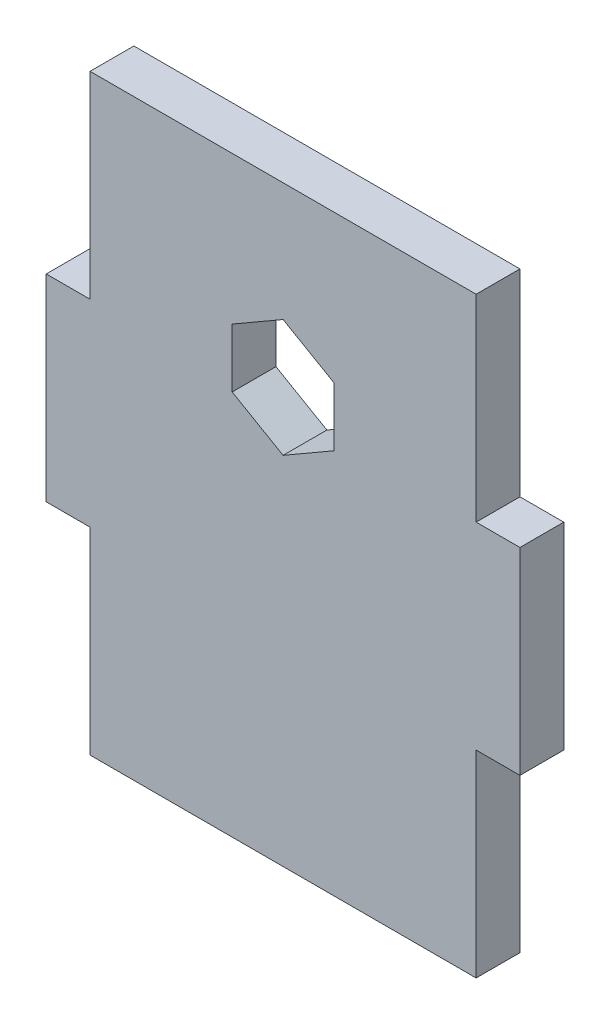
ISO-10303-21;
HEADER;
FILE_DESCRIPTION(('STEP AP214'),'2;1');
FILE_NAME('part.step','',(''),(''),'','','');
FILE_SCHEMA(('AUTOMOTIVE_DESIGN { 1 0 10303 214 1 1 1 1 }'));
ENDSEC;
DATA;
#1=APPLICATION_CONTEXT('core data for automotive mechanical design processes');
#2=APPLICATION_PROTOCOL_DEFINITION('international standard','automotive_design',2000,#1);
#3=PRODUCT_CONTEXT('',#1,'mechanical');
#4=PRODUCT('Part','Part','',(#3));
#5=PRODUCT_RELATED_PRODUCT_CATEGORY('part','',(#4));
#6=PRODUCT_DEFINITION_FORMATION('','',#4);
#7=PRODUCT_DEFINITION_CONTEXT('part definition',#1,'design');
#8=PRODUCT_DEFINITION('design','',#6,#7);
#9=PRODUCT_DEFINITION_SHAPE('','',#8);
#10=(LENGTH_UNIT() NAMED_UNIT(*) SI_UNIT(.MILLI.,.METRE.));
#11=(NAMED_UNIT(*) PLANE_ANGLE_UNIT() SI_UNIT($,.RADIAN.));
#12=(NAMED_UNIT(*) SI_UNIT($,.STERADIAN.) SOLID_ANGLE_UNIT());
#13=UNCERTAINTY_MEASURE_WITH_UNIT(LENGTH_MEASURE(1.E-05),#10,'distance_accuracy_value','');
#14=(GEOMETRIC_REPRESENTATION_CONTEXT(3) GLOBAL_UNCERTAINTY_ASSIGNED_CONTEXT((#13)) GLOBAL_UNIT_ASSIGNED_CONTEXT((#10,
#11,#12)) REPRESENTATION_CONTEXT('',''));
#15=CARTESIAN_POINT('',(0.,0.,0.));
#16=DIRECTION('',(0.,0.,1.));
#17=DIRECTION('',(1.,0.,0.));
#18=AXIS2_PLACEMENT_3D('',#15,#16,#17);
#19=CARTESIAN_POINT('',(0.,0.,4.699));
#20=DIRECTION('',(0.,0.,1.));
#21=DIRECTION('',(1.,0.,0.));
#22=AXIS2_PLACEMENT_3D('',#19,#20,#21);
#23=PLANE('',#22);
#24=DIRECTION('',(0.,-1.,0.));
#25=VECTOR('',#24,1.);
#26=CARTESIAN_POINT('',(0.,0.,4.699));
#27=LINE('',#26,#25);
#28=CARTESIAN_POINT('',(0.,21.1666666666667,4.699));
#29=VERTEX_POINT('',#28);
#30=CARTESIAN_POINT('',(0.,0.,4.699));
#31=VERTEX_POINT('',#30);
#32=EDGE_CURVE('E196',#29,#31,#27,.T.);
#33=ORIENTED_EDGE('',*,*,#32,.T.);
#34=DIRECTION('',(1.,0.,0.));
#35=VECTOR('',#34,1.);
#36=CARTESIAN_POINT('',(0.,0.,4.699));
#37=LINE('',#36,#35);
#38=CARTESIAN_POINT('',(41.402,0.,4.699));
#39=VERTEX_POINT('',#38);
#40=EDGE_CURVE('E199',#31,#39,#37,.T.);
#41=ORIENTED_EDGE('',*,*,#40,.T.);
#42=DIRECTION('',(0.,1.,0.));
#43=VECTOR('',#42,1.);
#44=CARTESIAN_POINT('',(41.402,0.,4.699));
#45=LINE('',#44,#43);
#46=CARTESIAN_POINT('',(41.402,21.1666666666667,4.699));
#47=VERTEX_POINT('',#46);
#48=EDGE_CURVE('E202',#39,#47,#45,.T.);
#49=ORIENTED_EDGE('',*,*,#48,.T.);
#50=DIRECTION('',(1.,0.,0.));
#51=VECTOR('',#50,1.);
#52=CARTESIAN_POINT('',(41.402,21.1666666666667,4.699));
#53=LINE('',#52,#51);
#54=CARTESIAN_POINT('',(46.101,21.1666666666667,4.699));
#55=VERTEX_POINT('',#54);
#56=EDGE_CURVE('E204',#47,#55,#53,.T.);
#57=ORIENTED_EDGE('',*,*,#56,.T.);
#58=DIRECTION('',(0.,1.,0.));
#59=VECTOR('',#58,1.);
#60=CARTESIAN_POINT('',(46.101,42.3333333333333,4.699));
#61=LINE('',#60,#59);
#62=CARTESIAN_POINT('',(46.101,42.3333333333333,4.699));
#63=VERTEX_POINT('',#62);
#64=EDGE_CURVE('E206',#55,#63,#61,.T.);
#65=ORIENTED_EDGE('',*,*,#64,.T.);
#66=DIRECTION('',(-1.,0.,0.));
#67=VECTOR('',#66,1.);
#68=CARTESIAN_POINT('',(41.402,42.3333333333333,4.699));
#69=LINE('',#68,#67);
#70=CARTESIAN_POINT('',(41.402,42.3333333333333,4.699));
#71=VERTEX_POINT('',#70);
#72=EDGE_CURVE('E208',#63,#71,#69,.T.);
#73=ORIENTED_EDGE('',*,*,#72,.T.);
#74=DIRECTION('',(0.,1.,0.));
#75=VECTOR('',#74,1.);
#76=CARTESIAN_POINT('',(41.402,42.3333333333333,4.699));
#77=LINE('',#76,#75);
#78=CARTESIAN_POINT('',(41.402,63.5,4.699));
#79=VERTEX_POINT('',#78);
#80=EDGE_CURVE('E210',#71,#79,#77,.T.);
#81=ORIENTED_EDGE('',*,*,#80,.T.);
#82=DIRECTION('',(-1.,0.,0.));
#83=VECTOR('',#82,1.);
#84=CARTESIAN_POINT('',(0.,63.5,4.699));
#85=LINE('',#84,#83);
#86=CARTESIAN_POINT('',(0.,63.5,4.699));
#87=VERTEX_POINT('',#86);
#88=EDGE_CURVE('E212',#79,#87,#85,.T.);
#89=ORIENTED_EDGE('',*,*,#88,.T.);
#90=DIRECTION('',(0.,-1.,0.));
#91=VECTOR('',#90,1.);
#92=CARTESIAN_POINT('',(0.,42.3333333333333,4.699));
#93=LINE('',#92,#91);
#94=CARTESIAN_POINT('',(0.,42.3333333333333,4.699));
#95=VERTEX_POINT('',#94);
#96=EDGE_CURVE('E214',#87,#95,#93,.T.);
#97=ORIENTED_EDGE('',*,*,#96,.T.);
#98=DIRECTION('',(-1.,0.,0.));
#99=VECTOR('',#98,1.);
#100=CARTESIAN_POINT('',(0.,42.3333333333333,4.699));
#101=LINE('',#100,#99);
#102=CARTESIAN_POINT('',(-4.699,42.3333333333333,4.699));
#103=VERTEX_POINT('',#102);
#104=EDGE_CURVE('E216',#95,#103,#101,.T.);
#105=ORIENTED_EDGE('',*,*,#104,.T.);
#106=DIRECTION('',(0.,-1.,0.));
#107=VECTOR('',#106,1.);
#108=CARTESIAN_POINT('',(-4.699,42.3333333333333,4.699));
#109=LINE('',#108,#107);
#110=CARTESIAN_POINT('',(-4.699,21.1666666666667,4.699));
#111=VERTEX_POINT('',#110);
#112=EDGE_CURVE('E218',#103,#111,#109,.T.);
#113=ORIENTED_EDGE('',*,*,#112,.T.);
#114=DIRECTION('',(1.,0.,0.));
#115=VECTOR('',#114,1.);
#116=CARTESIAN_POINT('',(0.,21.1666666666667,4.699));
#117=LINE('',#116,#115);
#118=EDGE_CURVE('E220',#111,#29,#117,.T.);
#119=ORIENTED_EDGE('',*,*,#118,.T.);
#120=EDGE_LOOP('',(#33,#41,#49,#57,#65,#73,#81,#89,#97,#105,#113,#119));
#121=FACE_BOUND('',#120,.T.);
#122=DIRECTION('',(0.866025403784436,0.500000000000005,0.));
#123=VECTOR('',#122,1.);
#124=CARTESIAN_POINT('',(26.162,41.3412705398664,4.69899999999999));
#125=LINE('',#124,#123);
#126=CARTESIAN_POINT('',(20.701,38.1883607198218,4.69899999999999));
#127=VERTEX_POINT('',#126);
#128=CARTESIAN_POINT('',(26.162,41.3412705398664,4.69899999999999));
#129=VERTEX_POINT('',#128);
#130=EDGE_CURVE('E165',#127,#129,#125,.T.);
#131=ORIENTED_EDGE('',*,*,#130,.F.);
#132=DIRECTION('',(0.86602540378444,-0.499999999999998,0.));
#133=VECTOR('',#132,1.);
#134=CARTESIAN_POINT('',(20.701,38.1883607198218,4.69899999999999));
#135=LINE('',#134,#133);
#136=CARTESIAN_POINT('',(15.24,41.3412705398663,4.69899999999999));
#137=VERTEX_POINT('',#136);
#138=EDGE_CURVE('E157',#137,#127,#135,.T.);
#139=ORIENTED_EDGE('',*,*,#138,.F.);
#140=DIRECTION('',(0.,-1.,0.));
#141=VECTOR('',#140,1.);
#142=CARTESIAN_POINT('',(15.24,41.3412705398663,4.69899999999999));
#143=LINE('',#142,#141);
#144=CARTESIAN_POINT('',(15.24,47.6470901799554,4.699));
#145=VERTEX_POINT('',#144);
#146=EDGE_CURVE('E185',#145,#137,#143,.T.);
#147=ORIENTED_EDGE('',*,*,#146,.F.);
#148=DIRECTION('',(-0.866025403784436,-0.500000000000004,0.));
#149=VECTOR('',#148,1.);
#150=CARTESIAN_POINT('',(15.24,47.6470901799554,4.69899999999999));
#151=LINE('',#150,#149);
#152=CARTESIAN_POINT('',(20.701,50.8,4.69899999999999));
#153=VERTEX_POINT('',#152);
#154=EDGE_CURVE('E183',#153,#145,#151,.T.);
#155=ORIENTED_EDGE('',*,*,#154,.F.);
#156=DIRECTION('',(-0.86602540378444,0.499999999999998,0.));
#157=VECTOR('',#156,1.);
#158=CARTESIAN_POINT('',(20.701,50.8,4.69899999999999));
#159=LINE('',#158,#157);
#160=CARTESIAN_POINT('',(26.162,47.6470901799555,4.69899999999999));
#161=VERTEX_POINT('',#160);
#162=EDGE_CURVE('E179',#161,#153,#159,.T.);
#163=ORIENTED_EDGE('',*,*,#162,.F.);
#164=DIRECTION('',(0.,1.,0.));
#165=VECTOR('',#164,1.);
#166=CARTESIAN_POINT('',(26.162,47.6470901799555,4.69899999999999));
#167=LINE('',#166,#165);
#168=EDGE_CURVE('E177',#129,#161,#167,.T.);
#169=ORIENTED_EDGE('',*,*,#168,.F.);
#170=EDGE_LOOP('',(#131,#139,#147,#155,#163,#169));
#171=FACE_BOUND('',#170,.T.);
#172=ADVANCED_FACE('F34',(#121,#171),#23,.T.);
#173=CARTESIAN_POINT('',(0.,0.,0.));
#174=DIRECTION('',(0.,0.,1.));
#175=DIRECTION('',(1.,0.,0.));
#176=AXIS2_PLACEMENT_3D('',#173,#174,#175);
#177=PLANE('',#176);
#178=DIRECTION('',(0.,-1.,0.));
#179=VECTOR('',#178,1.);
#180=CARTESIAN_POINT('',(0.,0.,0.));
#181=LINE('',#180,#179);
#182=CARTESIAN_POINT('',(0.,21.1666666666667,0.));
#183=VERTEX_POINT('',#182);
#184=CARTESIAN_POINT('',(0.,0.,0.));
#185=VERTEX_POINT('',#184);
#186=EDGE_CURVE('E172',#183,#185,#181,.T.);
#187=ORIENTED_EDGE('',*,*,#186,.F.);
#188=DIRECTION('',(1.,0.,0.));
#189=VECTOR('',#188,1.);
#190=CARTESIAN_POINT('',(0.,21.1666666666667,0.));
#191=LINE('',#190,#189);
#192=CARTESIAN_POINT('',(-4.699,21.1666666666667,0.));
#193=VERTEX_POINT('',#192);
#194=EDGE_CURVE('E200',#193,#183,#191,.T.);
#195=ORIENTED_EDGE('',*,*,#194,.F.);
#196=DIRECTION('',(0.,-1.,0.));
#197=VECTOR('',#196,1.);
#198=CARTESIAN_POINT('',(-4.699,42.3333333333333,0.));
#199=LINE('',#198,#197);
#200=CARTESIAN_POINT('',(-4.699,42.3333333333333,0.));
#201=VERTEX_POINT('',#200);
#202=EDGE_CURVE('E243',#201,#193,#199,.T.);
#203=ORIENTED_EDGE('',*,*,#202,.F.);
#204=DIRECTION('',(-1.,0.,0.));
#205=VECTOR('',#204,1.);
#206=CARTESIAN_POINT('',(0.,42.3333333333333,0.));
#207=LINE('',#206,#205);
#208=CARTESIAN_POINT('',(0.,42.3333333333333,0.));
#209=VERTEX_POINT('',#208);
#210=EDGE_CURVE('E241',#209,#201,#207,.T.);
#211=ORIENTED_EDGE('',*,*,#210,.F.);
#212=DIRECTION('',(0.,-1.,0.));
#213=VECTOR('',#212,1.);
#214=CARTESIAN_POINT('',(0.,42.3333333333333,0.));
#215=LINE('',#214,#213);
#216=CARTESIAN_POINT('',(0.,63.5,0.));
#217=VERTEX_POINT('',#216);
#218=EDGE_CURVE('E239',#217,#209,#215,.T.);
#219=ORIENTED_EDGE('',*,*,#218,.F.);
#220=DIRECTION('',(-1.,0.,0.));
#221=VECTOR('',#220,1.);
#222=CARTESIAN_POINT('',(0.,63.5,0.));
#223=LINE('',#222,#221);
#224=CARTESIAN_POINT('',(41.402,63.5,0.));
#225=VERTEX_POINT('',#224);
#226=EDGE_CURVE('E237',#225,#217,#223,.T.);
#227=ORIENTED_EDGE('',*,*,#226,.F.);
#228=DIRECTION('',(0.,1.,0.));
#229=VECTOR('',#228,1.);
#230=CARTESIAN_POINT('',(41.402,42.3333333333333,0.));
#231=LINE('',#230,#229);
#232=CARTESIAN_POINT('',(41.402,42.3333333333333,0.));
#233=VERTEX_POINT('',#232);
#234=EDGE_CURVE('E235',#233,#225,#231,.T.);
#235=ORIENTED_EDGE('',*,*,#234,.F.);
#236=DIRECTION('',(-1.,0.,0.));
#237=VECTOR('',#236,1.);
#238=CARTESIAN_POINT('',(41.402,42.3333333333333,0.));
#239=LINE('',#238,#237);
#240=CARTESIAN_POINT('',(46.101,42.3333333333333,0.));
#241=VERTEX_POINT('',#240);
#242=EDGE_CURVE('E233',#241,#233,#239,.T.);
#243=ORIENTED_EDGE('',*,*,#242,.F.);
#244=DIRECTION('',(0.,1.,0.));
#245=VECTOR('',#244,1.);
#246=CARTESIAN_POINT('',(46.101,42.3333333333333,0.));
#247=LINE('',#246,#245);
#248=CARTESIAN_POINT('',(46.101,21.1666666666667,0.));
#249=VERTEX_POINT('',#248);
#250=EDGE_CURVE('E231',#249,#241,#247,.T.);
#251=ORIENTED_EDGE('',*,*,#250,.F.);
#252=DIRECTION('',(1.,0.,0.));
#253=VECTOR('',#252,1.);
#254=CARTESIAN_POINT('',(41.402,21.1666666666667,0.));
#255=LINE('',#254,#253);
#256=CARTESIAN_POINT('',(41.402,21.1666666666667,0.));
#257=VERTEX_POINT('',#256);
#258=EDGE_CURVE('E229',#257,#249,#255,.T.);
#259=ORIENTED_EDGE('',*,*,#258,.F.);
#260=DIRECTION('',(0.,1.,0.));
#261=VECTOR('',#260,1.);
#262=CARTESIAN_POINT('',(41.402,0.,0.));
#263=LINE('',#262,#261);
#264=CARTESIAN_POINT('',(41.402,0.,0.));
#265=VERTEX_POINT('',#264);
#266=EDGE_CURVE('E227',#265,#257,#263,.T.);
#267=ORIENTED_EDGE('',*,*,#266,.F.);
#268=DIRECTION('',(1.,0.,0.));
#269=VECTOR('',#268,1.);
#270=CARTESIAN_POINT('',(0.,0.,0.));
#271=LINE('',#270,#269);
#272=EDGE_CURVE('E225',#185,#265,#271,.T.);
#273=ORIENTED_EDGE('',*,*,#272,.F.);
#274=EDGE_LOOP('',(#187,#195,#203,#211,#219,#227,#235,#243,#251,#259,#267,#273));
#275=FACE_BOUND('',#274,.T.);
#276=DIRECTION('',(-0.86602540378444,0.499999999999998,0.));
#277=VECTOR('',#276,1.);
#278=CARTESIAN_POINT('',(21.7112952561247,37.6050664817372,0.));
#279=LINE('',#278,#277);
#280=CARTESIAN_POINT('',(20.701,38.1883607198218,0.));
#281=VERTEX_POINT('',#280);
#282=CARTESIAN_POINT('',(15.24,41.3412705398663,0.));
#283=VERTEX_POINT('',#282);
#284=EDGE_CURVE('E11',#281,#283,#279,.T.);
#285=ORIENTED_EDGE('',*,*,#284,.F.);
#286=DIRECTION('',(-0.866025403784436,-0.500000000000004,0.));
#287=VECTOR('',#286,1.);
#288=CARTESIAN_POINT('',(-11.3607952561247,19.6774745979953,0.));
#289=LINE('',#288,#287);
#290=CARTESIAN_POINT('',(26.162,41.3412705398664,0.));
#291=VERTEX_POINT('',#290);
#292=EDGE_CURVE('E42',#291,#281,#289,.T.);
#293=ORIENTED_EDGE('',*,*,#292,.F.);
#294=DIRECTION('',(0.,-1.,0.));
#295=VECTOR('',#294,1.);
#296=CARTESIAN_POINT('',(26.162,0.,0.));
#297=LINE('',#296,#295);
#298=CARTESIAN_POINT('',(26.162,47.6470901799555,0.));
#299=VERTEX_POINT('',#298);
#300=EDGE_CURVE('E287',#299,#291,#297,.T.);
#301=ORIENTED_EDGE('',*,*,#300,.F.);
#302=DIRECTION('',(0.86602540378444,-0.499999999999998,0.));
#303=VECTOR('',#302,1.);
#304=CARTESIAN_POINT('',(27.1722952561246,47.0637959418709,0.));
#305=LINE('',#304,#303);
#306=CARTESIAN_POINT('',(20.701,50.8,0.));
#307=VERTEX_POINT('',#306);
#308=EDGE_CURVE('E285',#307,#299,#305,.T.);
#309=ORIENTED_EDGE('',*,*,#308,.F.);
#310=DIRECTION('',(0.866025403784436,0.500000000000004,0.));
#311=VECTOR('',#310,1.);
#312=CARTESIAN_POINT('',(-16.8217952561248,29.1362040581289,0.));
#313=LINE('',#312,#311);
#314=CARTESIAN_POINT('',(15.24,47.6470901799554,0.));
#315=VERTEX_POINT('',#314);
#316=EDGE_CURVE('E283',#315,#307,#313,.T.);
#317=ORIENTED_EDGE('',*,*,#316,.F.);
#318=DIRECTION('',(0.,1.,0.));
#319=VECTOR('',#318,1.);
#320=CARTESIAN_POINT('',(15.24,0.,0.));
#321=LINE('',#320,#319);
#322=EDGE_CURVE('E281',#283,#315,#321,.T.);
#323=ORIENTED_EDGE('',*,*,#322,.F.);
#324=EDGE_LOOP('',(#285,#293,#301,#309,#317,#323));
#325=FACE_BOUND('',#324,.T.);
#326=ADVANCED_FACE('F294',(#275,#325),#177,.F.);
#327=CARTESIAN_POINT('',(0.,0.,4.699));
#328=DIRECTION('',(1.,0.,0.));
#329=DIRECTION('',(0.,0.,-1.));
#330=AXIS2_PLACEMENT_3D('',#327,#328,#329);
#331=PLANE('',#330);
#332=ORIENTED_EDGE('',*,*,#186,.T.);
#333=DIRECTION('',(0.,0.,-1.));
#334=VECTOR('',#333,1.);
#335=CARTESIAN_POINT('',(0.,0.,4.699));
#336=LINE('',#335,#334);
#337=EDGE_CURVE('E278',#31,#185,#336,.T.);
#338=ORIENTED_EDGE('',*,*,#337,.F.);
#339=ORIENTED_EDGE('',*,*,#32,.F.);
#340=DIRECTION('',(0.,0.,-1.));
#341=VECTOR('',#340,1.);
#342=CARTESIAN_POINT('',(0.,21.1666666666667,4.699));
#343=LINE('',#342,#341);
#344=EDGE_CURVE('E222',#29,#183,#343,.T.);
#345=ORIENTED_EDGE('',*,*,#344,.T.);
#346=EDGE_LOOP('',(#332,#338,#339,#345));
#347=FACE_BOUND('',#346,.T.);
#348=ADVANCED_FACE('F36',(#347),#331,.F.);
#349=CARTESIAN_POINT('',(0.,0.,4.699));
#350=DIRECTION('',(0.,1.,0.));
#351=DIRECTION('',(0.,0.,1.));
#352=AXIS2_PLACEMENT_3D('',#349,#350,#351);
#353=PLANE('',#352);
#354=ORIENTED_EDGE('',*,*,#272,.T.);
#355=DIRECTION('',(0.,0.,-1.));
#356=VECTOR('',#355,1.);
#357=CARTESIAN_POINT('',(41.402,0.,4.699));
#358=LINE('',#357,#356);
#359=EDGE_CURVE('E275',#39,#265,#358,.T.);
#360=ORIENTED_EDGE('',*,*,#359,.F.);
#361=ORIENTED_EDGE('',*,*,#40,.F.);
#362=ORIENTED_EDGE('',*,*,#337,.T.);
#363=EDGE_LOOP('',(#354,#360,#361,#362));
#364=FACE_BOUND('',#363,.T.);
#365=ADVANCED_FACE('F361',(#364),#353,.F.);
#366=CARTESIAN_POINT('',(41.402,0.,4.699));
#367=DIRECTION('',(-1.,0.,0.));
#368=DIRECTION('',(0.,0.,1.));
#369=AXIS2_PLACEMENT_3D('',#366,#367,#368);
#370=PLANE('',#369);
#371=ORIENTED_EDGE('',*,*,#266,.T.);
#372=DIRECTION('',(0.,0.,-1.));
#373=VECTOR('',#372,1.);
#374=CARTESIAN_POINT('',(41.402,21.1666666666667,4.699));
#375=LINE('',#374,#373);
#376=EDGE_CURVE('E272',#47,#257,#375,.T.);
#377=ORIENTED_EDGE('',*,*,#376,.F.);
#378=ORIENTED_EDGE('',*,*,#48,.F.);
#379=ORIENTED_EDGE('',*,*,#359,.T.);
#380=EDGE_LOOP('',(#371,#377,#378,#379));
#381=FACE_BOUND('',#380,.T.);
#382=ADVANCED_FACE('F358',(#381),#370,.F.);
#383=CARTESIAN_POINT('',(41.402,21.1666666666667,4.699));
#384=DIRECTION('',(0.,1.,0.));
#385=DIRECTION('',(0.,0.,1.));
#386=AXIS2_PLACEMENT_3D('',#383,#384,#385);
#387=PLANE('',#386);
#388=ORIENTED_EDGE('',*,*,#258,.T.);
#389=DIRECTION('',(0.,0.,-1.));
#390=VECTOR('',#389,1.);
#391=CARTESIAN_POINT('',(46.101,21.1666666666667,4.699));
#392=LINE('',#391,#390);
#393=EDGE_CURVE('E269',#55,#249,#392,.T.);
#394=ORIENTED_EDGE('',*,*,#393,.F.);
#395=ORIENTED_EDGE('',*,*,#56,.F.);
#396=ORIENTED_EDGE('',*,*,#376,.T.);
#397=EDGE_LOOP('',(#388,#394,#395,#396));
#398=FACE_BOUND('',#397,.T.);
#399=ADVANCED_FACE('F354',(#398),#387,.F.);
#400=CARTESIAN_POINT('',(46.101,42.3333333333333,4.699));
#401=DIRECTION('',(-1.,0.,0.));
#402=DIRECTION('',(0.,0.,1.));
#403=AXIS2_PLACEMENT_3D('',#400,#401,#402);
#404=PLANE('',#403);
#405=ORIENTED_EDGE('',*,*,#250,.T.);
#406=DIRECTION('',(0.,0.,-1.));
#407=VECTOR('',#406,1.);
#408=CARTESIAN_POINT('',(46.101,42.3333333333333,4.699));
#409=LINE('',#408,#407);
#410=EDGE_CURVE('E266',#63,#241,#409,.T.);
#411=ORIENTED_EDGE('',*,*,#410,.F.);
#412=ORIENTED_EDGE('',*,*,#64,.F.);
#413=ORIENTED_EDGE('',*,*,#393,.T.);
#414=EDGE_LOOP('',(#405,#411,#412,#413));
#415=FACE_BOUND('',#414,.T.);
#416=ADVANCED_FACE('F350',(#415),#404,.F.);
#417=CARTESIAN_POINT('',(41.402,42.3333333333333,4.699));
#418=DIRECTION('',(0.,-1.,0.));
#419=DIRECTION('',(0.,0.,-1.));
#420=AXIS2_PLACEMENT_3D('',#417,#418,#419);
#421=PLANE('',#420);
#422=ORIENTED_EDGE('',*,*,#242,.T.);
#423=DIRECTION('',(0.,0.,-1.));
#424=VECTOR('',#423,1.);
#425=CARTESIAN_POINT('',(41.402,42.3333333333333,4.699));
#426=LINE('',#425,#424);
#427=EDGE_CURVE('E263',#71,#233,#426,.T.);
#428=ORIENTED_EDGE('',*,*,#427,.F.);
#429=ORIENTED_EDGE('',*,*,#72,.F.);
#430=ORIENTED_EDGE('',*,*,#410,.T.);
#431=EDGE_LOOP('',(#422,#428,#429,#430));
#432=FACE_BOUND('',#431,.T.);
#433=ADVANCED_FACE('F346',(#432),#421,.F.);
#434=CARTESIAN_POINT('',(41.402,42.3333333333333,4.699));
#435=DIRECTION('',(-1.,0.,0.));
#436=DIRECTION('',(0.,0.,1.));
#437=AXIS2_PLACEMENT_3D('',#434,#435,#436);
#438=PLANE('',#437);
#439=ORIENTED_EDGE('',*,*,#234,.T.);
#440=DIRECTION('',(0.,0.,-1.));
#441=VECTOR('',#440,1.);
#442=CARTESIAN_POINT('',(41.402,63.5,4.699));
#443=LINE('',#442,#441);
#444=EDGE_CURVE('E260',#79,#225,#443,.T.);
#445=ORIENTED_EDGE('',*,*,#444,.F.);
#446=ORIENTED_EDGE('',*,*,#80,.F.);
#447=ORIENTED_EDGE('',*,*,#427,.T.);
#448=EDGE_LOOP('',(#439,#445,#446,#447));
#449=FACE_BOUND('',#448,.T.);
#450=ADVANCED_FACE('F342',(#449),#438,.F.);
#451=CARTESIAN_POINT('',(0.,63.5,4.699));
#452=DIRECTION('',(0.,-1.,0.));
#453=DIRECTION('',(0.,0.,-1.));
#454=AXIS2_PLACEMENT_3D('',#451,#452,#453);
#455=PLANE('',#454);
#456=ORIENTED_EDGE('',*,*,#226,.T.);
#457=DIRECTION('',(0.,0.,-1.));
#458=VECTOR('',#457,1.);
#459=CARTESIAN_POINT('',(0.,63.5,4.699));
#460=LINE('',#459,#458);
#461=EDGE_CURVE('E257',#87,#217,#460,.T.);
#462=ORIENTED_EDGE('',*,*,#461,.F.);
#463=ORIENTED_EDGE('',*,*,#88,.F.);
#464=ORIENTED_EDGE('',*,*,#444,.T.);
#465=EDGE_LOOP('',(#456,#462,#463,#464));
#466=FACE_BOUND('',#465,.T.);
#467=ADVANCED_FACE('F338',(#466),#455,.F.);
#468=CARTESIAN_POINT('',(0.,42.3333333333333,4.699));
#469=DIRECTION('',(1.,0.,0.));
#470=DIRECTION('',(0.,0.,-1.));
#471=AXIS2_PLACEMENT_3D('',#468,#469,#470);
#472=PLANE('',#471);
#473=ORIENTED_EDGE('',*,*,#218,.T.);
#474=DIRECTION('',(0.,0.,-1.));
#475=VECTOR('',#474,1.);
#476=CARTESIAN_POINT('',(0.,42.3333333333333,4.699));
#477=LINE('',#476,#475);
#478=EDGE_CURVE('E254',#95,#209,#477,.T.);
#479=ORIENTED_EDGE('',*,*,#478,.F.);
#480=ORIENTED_EDGE('',*,*,#96,.F.);
#481=ORIENTED_EDGE('',*,*,#461,.T.);
#482=EDGE_LOOP('',(#473,#479,#480,#481));
#483=FACE_BOUND('',#482,.T.);
#484=ADVANCED_FACE('F334',(#483),#472,.F.);
#485=CARTESIAN_POINT('',(0.,42.3333333333333,4.699));
#486=DIRECTION('',(0.,-1.,0.));
#487=DIRECTION('',(1.,0.,0.));
#488=AXIS2_PLACEMENT_3D('',#485,#486,#487);
#489=PLANE('',#488);
#490=ORIENTED_EDGE('',*,*,#210,.T.);
#491=DIRECTION('',(0.,0.,-1.));
#492=VECTOR('',#491,1.);
#493=CARTESIAN_POINT('',(-4.699,42.3333333333333,4.699));
#494=LINE('',#493,#492);
#495=EDGE_CURVE('E251',#103,#201,#494,.T.);
#496=ORIENTED_EDGE('',*,*,#495,.F.);
#497=ORIENTED_EDGE('',*,*,#104,.F.);
#498=ORIENTED_EDGE('',*,*,#478,.T.);
#499=EDGE_LOOP('',(#490,#496,#497,#498));
#500=FACE_BOUND('',#499,.T.);
#501=ADVANCED_FACE('F330',(#500),#489,.F.);
#502=CARTESIAN_POINT('',(-4.699,42.3333333333333,4.699));
#503=DIRECTION('',(1.,0.,0.));
#504=DIRECTION('',(0.,1.,0.));
#505=AXIS2_PLACEMENT_3D('',#502,#503,#504);
#506=PLANE('',#505);
#507=ORIENTED_EDGE('',*,*,#202,.T.);
#508=DIRECTION('',(0.,0.,-1.));
#509=VECTOR('',#508,1.);
#510=CARTESIAN_POINT('',(-4.699,21.1666666666667,4.699));
#511=LINE('',#510,#509);
#512=EDGE_CURVE('E248',#111,#193,#511,.T.);
#513=ORIENTED_EDGE('',*,*,#512,.F.);
#514=ORIENTED_EDGE('',*,*,#112,.F.);
#515=ORIENTED_EDGE('',*,*,#495,.T.);
#516=EDGE_LOOP('',(#507,#513,#514,#515));
#517=FACE_BOUND('',#516,.T.);
#518=ADVANCED_FACE('F326',(#517),#506,.F.);
#519=CARTESIAN_POINT('',(0.,21.1666666666667,4.699));
#520=DIRECTION('',(0.,1.,0.));
#521=DIRECTION('',(0.,0.,1.));
#522=AXIS2_PLACEMENT_3D('',#519,#520,#521);
#523=PLANE('',#522);
#524=ORIENTED_EDGE('',*,*,#194,.T.);
#525=ORIENTED_EDGE('',*,*,#344,.F.);
#526=ORIENTED_EDGE('',*,*,#118,.F.);
#527=ORIENTED_EDGE('',*,*,#512,.T.);
#528=EDGE_LOOP('',(#524,#525,#526,#527));
#529=FACE_BOUND('',#528,.T.);
#530=ADVANCED_FACE('F323',(#529),#523,.F.);
#531=CARTESIAN_POINT('',(20.701,38.1883607198218,4.69899999999999));
#532=DIRECTION('',(0.499999999999998,0.86602540378444,0.));
#533=DIRECTION('',(-0.86602540378444,0.499999999999998,0.));
#534=AXIS2_PLACEMENT_3D('',#531,#532,#533);
#535=PLANE('',#534);
#536=ORIENTED_EDGE('',*,*,#284,.T.);
#537=DIRECTION('',(0.,0.,-1.));
#538=VECTOR('',#537,1.);
#539=CARTESIAN_POINT('',(15.24,41.3412705398663,4.69899999999999));
#540=LINE('',#539,#538);
#541=EDGE_CURVE('E54',#137,#283,#540,.T.);
#542=ORIENTED_EDGE('',*,*,#541,.F.);
#543=ORIENTED_EDGE('',*,*,#138,.T.);
#544=DIRECTION('',(0.,0.,-1.));
#545=VECTOR('',#544,1.);
#546=CARTESIAN_POINT('',(20.701,38.1883607198218,4.69899999999999));
#547=LINE('',#546,#545);
#548=EDGE_CURVE('E160',#127,#281,#547,.T.);
#549=ORIENTED_EDGE('',*,*,#548,.T.);
#550=EDGE_LOOP('',(#536,#542,#543,#549));
#551=FACE_BOUND('',#550,.T.);
#552=ADVANCED_FACE('F159',(#551),#535,.T.);
#553=CARTESIAN_POINT('',(26.162,41.3412705398664,4.69899999999999));
#554=DIRECTION('',(-0.500000000000004,0.866025403784436,0.));
#555=DIRECTION('',(-0.866025403784436,-0.500000000000004,0.));
#556=AXIS2_PLACEMENT_3D('',#553,#554,#555);
#557=PLANE('',#556);
#558=ORIENTED_EDGE('',*,*,#292,.T.);
#559=ORIENTED_EDGE('',*,*,#548,.F.);
#560=ORIENTED_EDGE('',*,*,#130,.T.);
#561=DIRECTION('',(0.,0.,-1.));
#562=VECTOR('',#561,1.);
#563=CARTESIAN_POINT('',(26.162,41.3412705398664,4.69899999999999));
#564=LINE('',#563,#562);
#565=EDGE_CURVE('E173',#129,#291,#564,.T.);
#566=ORIENTED_EDGE('',*,*,#565,.T.);
#567=EDGE_LOOP('',(#558,#559,#560,#566));
#568=FACE_BOUND('',#567,.T.);
#569=ADVANCED_FACE('F168',(#568),#557,.T.);
#570=CARTESIAN_POINT('',(26.162,47.6470901799555,4.69899999999999));
#571=DIRECTION('',(-1.,0.,0.));
#572=DIRECTION('',(0.,0.,1.));
#573=AXIS2_PLACEMENT_3D('',#570,#571,#572);
#574=PLANE('',#573);
#575=ORIENTED_EDGE('',*,*,#300,.T.);
#576=ORIENTED_EDGE('',*,*,#565,.F.);
#577=ORIENTED_EDGE('',*,*,#168,.T.);
#578=DIRECTION('',(0.,0.,-1.));
#579=VECTOR('',#578,1.);
#580=CARTESIAN_POINT('',(26.162,47.6470901799555,4.69899999999999));
#581=LINE('',#580,#579);
#582=EDGE_CURVE('E192',#161,#299,#581,.T.);
#583=ORIENTED_EDGE('',*,*,#582,.T.);
#584=EDGE_LOOP('',(#575,#576,#577,#583));
#585=FACE_BOUND('',#584,.T.);
#586=ADVANCED_FACE('F290',(#585),#574,.T.);
#587=CARTESIAN_POINT('',(20.701,50.8,4.69899999999999));
#588=DIRECTION('',(-0.499999999999998,-0.86602540378444,0.));
#589=DIRECTION('',(0.86602540378444,-0.499999999999998,0.));
#590=AXIS2_PLACEMENT_3D('',#587,#588,#589);
#591=PLANE('',#590);
#592=ORIENTED_EDGE('',*,*,#308,.T.);
#593=ORIENTED_EDGE('',*,*,#582,.F.);
#594=ORIENTED_EDGE('',*,*,#162,.T.);
#595=DIRECTION('',(0.,0.,-1.));
#596=VECTOR('',#595,1.);
#597=CARTESIAN_POINT('',(20.701,50.8,4.69899999999999));
#598=LINE('',#597,#596);
#599=EDGE_CURVE('E189',#153,#307,#598,.T.);
#600=ORIENTED_EDGE('',*,*,#599,.T.);
#601=EDGE_LOOP('',(#592,#593,#594,#600));
#602=FACE_BOUND('',#601,.T.);
#603=ADVANCED_FACE('F303',(#602),#591,.T.);
#604=CARTESIAN_POINT('',(15.24,47.6470901799554,4.69899999999999));
#605=DIRECTION('',(0.500000000000004,-0.866025403784436,0.));
#606=DIRECTION('',(0.866025403784436,0.500000000000004,0.));
#607=AXIS2_PLACEMENT_3D('',#604,#605,#606);
#608=PLANE('',#607);
#609=ORIENTED_EDGE('',*,*,#316,.T.);
#610=ORIENTED_EDGE('',*,*,#599,.F.);
#611=ORIENTED_EDGE('',*,*,#154,.T.);
#612=DIRECTION('',(0.,0.,-1.));
#613=VECTOR('',#612,1.);
#614=CARTESIAN_POINT('',(15.24,47.6470901799554,4.69899999999999));
#615=LINE('',#614,#613);
#616=EDGE_CURVE('E49',#145,#315,#615,.T.);
#617=ORIENTED_EDGE('',*,*,#616,.T.);
#618=EDGE_LOOP('',(#609,#610,#611,#617));
#619=FACE_BOUND('',#618,.T.);
#620=ADVANCED_FACE('F299',(#619),#608,.T.);
#621=CARTESIAN_POINT('',(15.24,41.3412705398663,4.69899999999999));
#622=DIRECTION('',(1.,0.,0.));
#623=DIRECTION('',(0.,0.,-1.));
#624=AXIS2_PLACEMENT_3D('',#621,#622,#623);
#625=PLANE('',#624);
#626=ORIENTED_EDGE('',*,*,#322,.T.);
#627=ORIENTED_EDGE('',*,*,#616,.F.);
#628=ORIENTED_EDGE('',*,*,#146,.T.);
#629=ORIENTED_EDGE('',*,*,#541,.T.);
#630=EDGE_LOOP('',(#626,#627,#628,#629));
#631=FACE_BOUND('',#630,.T.);
#632=ADVANCED_FACE('F297',(#631),#625,.T.);
#633=CLOSED_SHELL('',(#172,#326,#348,#365,#382,#399,#416,#433,#450,#467,#484,#501,#518,#530,
#552,#569,#586,#603,#620,#632));
#634=MANIFOLD_SOLID_BREP('B2',#633);
#635=ADVANCED_BREP_SHAPE_REPRESENTATION('',(#18,#634),#14);
#636=SHAPE_DEFINITION_REPRESENTATION(#9,#635);
ENDSEC;
END-ISO-10303-21;
